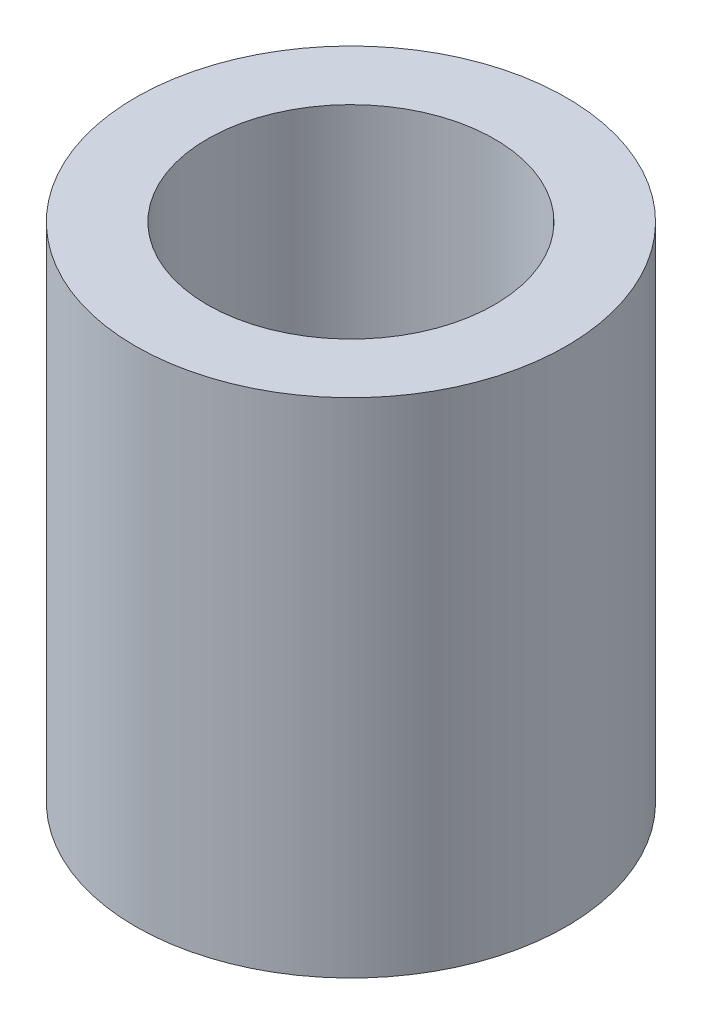
ISO-10303-21;
HEADER;
FILE_DESCRIPTION(('STEP AP214'),'2;1');
FILE_NAME('part.step','',(''),(''),'','','');
FILE_SCHEMA(('AUTOMOTIVE_DESIGN { 1 0 10303 214 1 1 1 1 }'));
ENDSEC;
DATA;
#1=APPLICATION_CONTEXT('core data for automotive mechanical design processes');
#2=APPLICATION_PROTOCOL_DEFINITION('international standard','automotive_design',2000,#1);
#3=PRODUCT_CONTEXT('',#1,'mechanical');
#4=PRODUCT('Part','Part','',(#3));
#5=PRODUCT_RELATED_PRODUCT_CATEGORY('part','',(#4));
#6=PRODUCT_DEFINITION_FORMATION('','',#4);
#7=PRODUCT_DEFINITION_CONTEXT('part definition',#1,'design');
#8=PRODUCT_DEFINITION('design','',#6,#7);
#9=PRODUCT_DEFINITION_SHAPE('','',#8);
#10=(LENGTH_UNIT() NAMED_UNIT(*) SI_UNIT(.MILLI.,.METRE.));
#11=(NAMED_UNIT(*) PLANE_ANGLE_UNIT() SI_UNIT($,.RADIAN.));
#12=(NAMED_UNIT(*) SI_UNIT($,.STERADIAN.) SOLID_ANGLE_UNIT());
#13=UNCERTAINTY_MEASURE_WITH_UNIT(LENGTH_MEASURE(1.E-05),#10,'distance_accuracy_value','');
#14=(GEOMETRIC_REPRESENTATION_CONTEXT(3) GLOBAL_UNCERTAINTY_ASSIGNED_CONTEXT((#13)) GLOBAL_UNIT_ASSIGNED_CONTEXT((#10,
#11,#12)) REPRESENTATION_CONTEXT('',''));
#15=CARTESIAN_POINT('',(0.,0.,0.));
#16=DIRECTION('',(0.,0.,1.));
#17=DIRECTION('',(1.,0.,0.));
#18=AXIS2_PLACEMENT_3D('',#15,#16,#17);
#19=CARTESIAN_POINT('',(0.,7.,0.));
#20=DIRECTION('',(0.,1.,0.));
#21=DIRECTION('',(0.,0.,1.));
#22=AXIS2_PLACEMENT_3D('',#19,#20,#21);
#23=PLANE('',#22);
#24=CARTESIAN_POINT('',(0.,7.,0.));
#25=DIRECTION('',(0.,1.,0.));
#26=DIRECTION('',(0.,0.,1.));
#27=AXIS2_PLACEMENT_3D('',#24,#25,#26);
#28=CIRCLE('',#27,3.);
#29=CARTESIAN_POINT('',(0.,7.,3.));
#30=VERTEX_POINT('',#29);
#31=EDGE_CURVE('E10',#30,#30,#28,.T.);
#32=ORIENTED_EDGE('',*,*,#31,.T.);
#33=EDGE_LOOP('',(#32));
#34=FACE_BOUND('',#33,.T.);
#35=CARTESIAN_POINT('',(0.,7.,0.));
#36=DIRECTION('',(0.,1.,0.));
#37=DIRECTION('',(0.,0.,1.));
#38=AXIS2_PLACEMENT_3D('',#35,#36,#37);
#39=CIRCLE('',#38,2.);
#40=CARTESIAN_POINT('',(0.,7.,2.));
#41=VERTEX_POINT('',#40);
#42=EDGE_CURVE('E44',#41,#41,#39,.T.);
#43=ORIENTED_EDGE('',*,*,#42,.F.);
#44=EDGE_LOOP('',(#43));
#45=FACE_BOUND('',#44,.T.);
#46=ADVANCED_FACE('F33',(#34,#45),#23,.T.);
#47=CARTESIAN_POINT('',(0.,0.,0.));
#48=DIRECTION('',(0.,1.,0.));
#49=DIRECTION('',(0.,0.,1.));
#50=AXIS2_PLACEMENT_3D('',#47,#48,#49);
#51=PLANE('',#50);
#52=CARTESIAN_POINT('',(0.,0.,0.));
#53=DIRECTION('',(0.,1.,0.));
#54=DIRECTION('',(0.,0.,1.));
#55=AXIS2_PLACEMENT_3D('',#52,#53,#54);
#56=CIRCLE('',#55,3.);
#57=CARTESIAN_POINT('',(0.,0.,3.));
#58=VERTEX_POINT('',#57);
#59=EDGE_CURVE('E37',#58,#58,#56,.T.);
#60=ORIENTED_EDGE('',*,*,#59,.F.);
#61=EDGE_LOOP('',(#60));
#62=FACE_BOUND('',#61,.T.);
#63=CARTESIAN_POINT('',(0.,0.,0.));
#64=DIRECTION('',(0.,1.,0.));
#65=DIRECTION('',(0.,0.,1.));
#66=AXIS2_PLACEMENT_3D('',#63,#64,#65);
#67=CIRCLE('',#66,2.);
#68=CARTESIAN_POINT('',(0.,0.,2.));
#69=VERTEX_POINT('',#68);
#70=EDGE_CURVE('E46',#69,#69,#67,.T.);
#71=ORIENTED_EDGE('',*,*,#70,.T.);
#72=EDGE_LOOP('',(#71));
#73=FACE_BOUND('',#72,.T.);
#74=ADVANCED_FACE('F56',(#62,#73),#51,.F.);
#75=CARTESIAN_POINT('',(0.,7.,0.));
#76=DIRECTION('',(0.,-1.,0.));
#77=DIRECTION('',(0.,0.,-1.));
#78=AXIS2_PLACEMENT_3D('',#75,#76,#77);
#79=CYLINDRICAL_SURFACE('',#78,3.);
#80=ORIENTED_EDGE('',*,*,#31,.F.);
#81=EDGE_LOOP('',(#80));
#82=FACE_BOUND('',#81,.T.);
#83=ORIENTED_EDGE('',*,*,#59,.T.);
#84=EDGE_LOOP('',(#83));
#85=FACE_BOUND('',#84,.T.);
#86=ADVANCED_FACE('F35',(#82,#85),#79,.T.);
#87=CARTESIAN_POINT('',(0.,7.,0.));
#88=DIRECTION('',(0.,-1.,0.));
#89=DIRECTION('',(0.,0.,-1.));
#90=AXIS2_PLACEMENT_3D('',#87,#88,#89);
#91=CYLINDRICAL_SURFACE('',#90,2.);
#92=ORIENTED_EDGE('',*,*,#42,.T.);
#93=EDGE_LOOP('',(#92));
#94=FACE_BOUND('',#93,.T.);
#95=ORIENTED_EDGE('',*,*,#70,.F.);
#96=EDGE_LOOP('',(#95));
#97=FACE_BOUND('',#96,.T.);
#98=ADVANCED_FACE('F52',(#94,#97),#91,.F.);
#99=CLOSED_SHELL('',(#46,#74,#86,#98));
#100=MANIFOLD_SOLID_BREP('B2',#99);
#101=ADVANCED_BREP_SHAPE_REPRESENTATION('',(#18,#100),#14);
#102=SHAPE_DEFINITION_REPRESENTATION(#9,#101);
ENDSEC;
END-ISO-10303-21;
